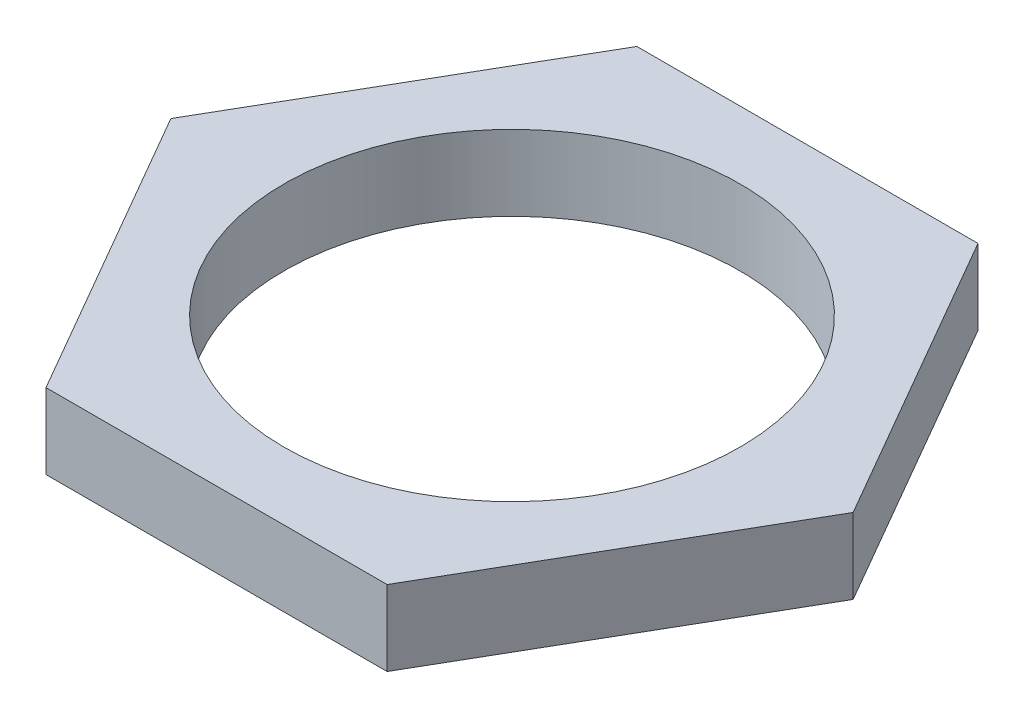
ISO-10303-21;
HEADER;
FILE_DESCRIPTION(('STEP AP214'),'2;1');
FILE_NAME('part.step','',(''),(''),'','','');
FILE_SCHEMA(('AUTOMOTIVE_DESIGN { 1 0 10303 214 1 1 1 1 }'));
ENDSEC;
DATA;
#1=APPLICATION_CONTEXT('core data for automotive mechanical design processes');
#2=APPLICATION_PROTOCOL_DEFINITION('international standard','automotive_design',2000,#1);
#3=PRODUCT_CONTEXT('',#1,'mechanical');
#4=PRODUCT('Part','Part','',(#3));
#5=PRODUCT_RELATED_PRODUCT_CATEGORY('part','',(#4));
#6=PRODUCT_DEFINITION_FORMATION('','',#4);
#7=PRODUCT_DEFINITION_CONTEXT('part definition',#1,'design');
#8=PRODUCT_DEFINITION('design','',#6,#7);
#9=PRODUCT_DEFINITION_SHAPE('','',#8);
#10=(LENGTH_UNIT() NAMED_UNIT(*) SI_UNIT(.MILLI.,.METRE.));
#11=(NAMED_UNIT(*) PLANE_ANGLE_UNIT() SI_UNIT($,.RADIAN.));
#12=(NAMED_UNIT(*) SI_UNIT($,.STERADIAN.) SOLID_ANGLE_UNIT());
#13=UNCERTAINTY_MEASURE_WITH_UNIT(LENGTH_MEASURE(1.E-05),#10,'distance_accuracy_value','');
#14=(GEOMETRIC_REPRESENTATION_CONTEXT(3) GLOBAL_UNCERTAINTY_ASSIGNED_CONTEXT((#13)) GLOBAL_UNIT_ASSIGNED_CONTEXT((#10,
#11,#12)) REPRESENTATION_CONTEXT('',''));
#15=CARTESIAN_POINT('',(0.,0.,0.));
#16=DIRECTION('',(0.,0.,1.));
#17=DIRECTION('',(1.,0.,0.));
#18=AXIS2_PLACEMENT_3D('',#15,#16,#17);
#19=CARTESIAN_POINT('',(0.,1.9,0.));
#20=DIRECTION('',(0.,1.,0.));
#21=DIRECTION('',(0.,0.,1.));
#22=AXIS2_PLACEMENT_3D('',#19,#20,#21);
#23=PLANE('',#22);
#24=DIRECTION('',(-0.499999999999995,0.,0.866025403784442));
#25=VECTOR('',#24,1.);
#26=CARTESIAN_POINT('',(-4.30125950546279,1.9,-7.44999999999994));
#27=LINE('',#26,#25);
#28=CARTESIAN_POINT('',(-4.30125950546279,1.9,-7.44999999999994));
#29=VERTEX_POINT('',#28);
#30=CARTESIAN_POINT('',(-8.60251901092541,1.9,0.));
#31=VERTEX_POINT('',#30);
#32=EDGE_CURVE('E129',#29,#31,#27,.T.);
#33=ORIENTED_EDGE('',*,*,#32,.T.);
#34=DIRECTION('',(0.500000000000001,0.,0.866025403784438));
#35=VECTOR('',#34,1.);
#36=CARTESIAN_POINT('',(-8.60251901092541,1.9,0.));
#37=LINE('',#36,#35);
#38=CARTESIAN_POINT('',(-4.30125950546269,1.9,7.45));
#39=VERTEX_POINT('',#38);
#40=EDGE_CURVE('E87',#31,#39,#37,.T.);
#41=ORIENTED_EDGE('',*,*,#40,.T.);
#42=DIRECTION('',(1.,0.,0.));
#43=VECTOR('',#42,1.);
#44=CARTESIAN_POINT('',(-4.30125950546269,1.9,7.45));
#45=LINE('',#44,#43);
#46=CARTESIAN_POINT('',(4.30125950546274,1.9,7.44999999999997));
#47=VERTEX_POINT('',#46);
#48=EDGE_CURVE('E100',#39,#47,#45,.T.);
#49=ORIENTED_EDGE('',*,*,#48,.T.);
#50=DIRECTION('',(0.499999999999995,0.,-0.866025403784442));
#51=VECTOR('',#50,1.);
#52=CARTESIAN_POINT('',(4.30125950546274,1.9,7.44999999999997));
#53=LINE('',#52,#51);
#54=CARTESIAN_POINT('',(8.60251901092541,1.9,0.));
#55=VERTEX_POINT('',#54);
#56=EDGE_CURVE('E94',#47,#55,#53,.T.);
#57=ORIENTED_EDGE('',*,*,#56,.T.);
#58=DIRECTION('',(-0.500000000000007,0.,-0.866025403784435));
#59=VECTOR('',#58,1.);
#60=CARTESIAN_POINT('',(8.60251901092541,1.9,0.));
#61=LINE('',#60,#59);
#62=CARTESIAN_POINT('',(4.30125950546264,1.9,-7.45000000000003));
#63=VERTEX_POINT('',#62);
#64=EDGE_CURVE('E98',#55,#63,#61,.T.);
#65=ORIENTED_EDGE('',*,*,#64,.T.);
#66=DIRECTION('',(-1.,0.,0.));
#67=VECTOR('',#66,1.);
#68=CARTESIAN_POINT('',(4.30125950546264,1.9,-7.45000000000003));
#69=LINE('',#68,#67);
#70=EDGE_CURVE('E50',#63,#29,#69,.T.);
#71=ORIENTED_EDGE('',*,*,#70,.T.);
#72=EDGE_LOOP('',(#33,#41,#49,#57,#65,#71));
#73=FACE_BOUND('',#72,.T.);
#74=CARTESIAN_POINT('',(0.,1.9,0.));
#75=DIRECTION('',(0.,1.,0.));
#76=DIRECTION('',(0.,0.,1.));
#77=AXIS2_PLACEMENT_3D('',#74,#75,#76);
#78=CIRCLE('',#77,5.75);
#79=CARTESIAN_POINT('',(0.,1.9,5.75));
#80=VERTEX_POINT('',#79);
#81=EDGE_CURVE('E122',#80,#80,#78,.T.);
#82=ORIENTED_EDGE('',*,*,#81,.F.);
#83=EDGE_LOOP('',(#82));
#84=FACE_BOUND('',#83,.T.);
#85=ADVANCED_FACE('F33',(#73,#84),#23,.T.);
#86=CARTESIAN_POINT('',(0.,0.,0.));
#87=DIRECTION('',(0.,1.,0.));
#88=DIRECTION('',(0.,0.,1.));
#89=AXIS2_PLACEMENT_3D('',#86,#87,#88);
#90=PLANE('',#89);
#91=DIRECTION('',(-0.499999999999995,0.,0.866025403784442));
#92=VECTOR('',#91,1.);
#93=CARTESIAN_POINT('',(-4.30125950546279,0.,-7.44999999999994));
#94=LINE('',#93,#92);
#95=CARTESIAN_POINT('',(-4.30125950546279,0.,-7.44999999999994));
#96=VERTEX_POINT('',#95);
#97=CARTESIAN_POINT('',(-8.60251901092541,0.,0.));
#98=VERTEX_POINT('',#97);
#99=EDGE_CURVE('E118',#96,#98,#94,.T.);
#100=ORIENTED_EDGE('',*,*,#99,.F.);
#101=DIRECTION('',(-1.,0.,0.));
#102=VECTOR('',#101,1.);
#103=CARTESIAN_POINT('',(4.30125950546264,0.,-7.45000000000003));
#104=LINE('',#103,#102);
#105=CARTESIAN_POINT('',(4.30125950546264,0.,-7.45000000000003));
#106=VERTEX_POINT('',#105);
#107=EDGE_CURVE('E79',#106,#96,#104,.T.);
#108=ORIENTED_EDGE('',*,*,#107,.F.);
#109=DIRECTION('',(-0.500000000000007,0.,-0.866025403784435));
#110=VECTOR('',#109,1.);
#111=CARTESIAN_POINT('',(8.60251901092541,0.,0.));
#112=LINE('',#111,#110);
#113=CARTESIAN_POINT('',(8.60251901092541,0.,0.));
#114=VERTEX_POINT('',#113);
#115=EDGE_CURVE('E73',#114,#106,#112,.T.);
#116=ORIENTED_EDGE('',*,*,#115,.F.);
#117=DIRECTION('',(0.499999999999995,0.,-0.866025403784442));
#118=VECTOR('',#117,1.);
#119=CARTESIAN_POINT('',(4.30125950546274,0.,7.44999999999997));
#120=LINE('',#119,#118);
#121=CARTESIAN_POINT('',(4.30125950546274,0.,7.44999999999997));
#122=VERTEX_POINT('',#121);
#123=EDGE_CURVE('E108',#122,#114,#120,.T.);
#124=ORIENTED_EDGE('',*,*,#123,.F.);
#125=DIRECTION('',(1.,0.,0.));
#126=VECTOR('',#125,1.);
#127=CARTESIAN_POINT('',(-4.30125950546269,0.,7.45));
#128=LINE('',#127,#126);
#129=CARTESIAN_POINT('',(-4.30125950546269,0.,7.45));
#130=VERTEX_POINT('',#129);
#131=EDGE_CURVE('E124',#130,#122,#128,.T.);
#132=ORIENTED_EDGE('',*,*,#131,.F.);
#133=DIRECTION('',(0.500000000000001,0.,0.866025403784438));
#134=VECTOR('',#133,1.);
#135=CARTESIAN_POINT('',(-8.60251901092541,0.,0.));
#136=LINE('',#135,#134);
#137=EDGE_CURVE('E121',#98,#130,#136,.T.);
#138=ORIENTED_EDGE('',*,*,#137,.F.);
#139=EDGE_LOOP('',(#100,#108,#116,#124,#132,#138));
#140=FACE_BOUND('',#139,.T.);
#141=CARTESIAN_POINT('',(0.,0.,0.));
#142=DIRECTION('',(0.,1.,0.));
#143=DIRECTION('',(0.,0.,1.));
#144=AXIS2_PLACEMENT_3D('',#141,#142,#143);
#145=CIRCLE('',#144,5.75);
#146=CARTESIAN_POINT('',(0.,0.,5.75));
#147=VERTEX_POINT('',#146);
#148=EDGE_CURVE('E222',#147,#147,#145,.T.);
#149=ORIENTED_EDGE('',*,*,#148,.T.);
#150=EDGE_LOOP('',(#149));
#151=FACE_BOUND('',#150,.T.);
#152=ADVANCED_FACE('F138',(#140,#151),#90,.F.);
#153=CARTESIAN_POINT('',(-4.30125950546279,1.9,-7.44999999999994));
#154=DIRECTION('',(0.866025403784442,0.,0.499999999999995));
#155=DIRECTION('',(0.499999999999995,0.,-0.866025403784442));
#156=AXIS2_PLACEMENT_3D('',#153,#154,#155);
#157=PLANE('',#156);
#158=ORIENTED_EDGE('',*,*,#99,.T.);
#159=DIRECTION('',(0.,-1.,0.));
#160=VECTOR('',#159,1.);
#161=CARTESIAN_POINT('',(-8.60251901092541,1.9,0.));
#162=LINE('',#161,#160);
#163=EDGE_CURVE('E11',#31,#98,#162,.T.);
#164=ORIENTED_EDGE('',*,*,#163,.F.);
#165=ORIENTED_EDGE('',*,*,#32,.F.);
#166=DIRECTION('',(0.,-1.,0.));
#167=VECTOR('',#166,1.);
#168=CARTESIAN_POINT('',(-4.30125950546279,1.9,-7.44999999999994));
#169=LINE('',#168,#167);
#170=EDGE_CURVE('E114',#29,#96,#169,.T.);
#171=ORIENTED_EDGE('',*,*,#170,.T.);
#172=EDGE_LOOP('',(#158,#164,#165,#171));
#173=FACE_BOUND('',#172,.T.);
#174=ADVANCED_FACE('F35',(#173),#157,.F.);
#175=CARTESIAN_POINT('',(-8.60251901092541,1.9,0.));
#176=DIRECTION('',(0.866025403784438,0.,-0.500000000000001));
#177=DIRECTION('',(-0.500000000000001,0.,-0.866025403784438));
#178=AXIS2_PLACEMENT_3D('',#175,#176,#177);
#179=PLANE('',#178);
#180=ORIENTED_EDGE('',*,*,#137,.T.);
#181=DIRECTION('',(0.,-1.,0.));
#182=VECTOR('',#181,1.);
#183=CARTESIAN_POINT('',(-4.30125950546269,1.9,7.45));
#184=LINE('',#183,#182);
#185=EDGE_CURVE('E42',#39,#130,#184,.T.);
#186=ORIENTED_EDGE('',*,*,#185,.F.);
#187=ORIENTED_EDGE('',*,*,#40,.F.);
#188=ORIENTED_EDGE('',*,*,#163,.T.);
#189=EDGE_LOOP('',(#180,#186,#187,#188));
#190=FACE_BOUND('',#189,.T.);
#191=ADVANCED_FACE('F163',(#190),#179,.F.);
#192=CARTESIAN_POINT('',(-4.30125950546269,1.9,7.45));
#193=DIRECTION('',(0.,0.,-1.));
#194=DIRECTION('',(-1.,0.,0.));
#195=AXIS2_PLACEMENT_3D('',#192,#193,#194);
#196=PLANE('',#195);
#197=ORIENTED_EDGE('',*,*,#131,.T.);
#198=DIRECTION('',(0.,-1.,0.));
#199=VECTOR('',#198,1.);
#200=CARTESIAN_POINT('',(4.30125950546274,1.9,7.44999999999997));
#201=LINE('',#200,#199);
#202=EDGE_CURVE('E109',#47,#122,#201,.T.);
#203=ORIENTED_EDGE('',*,*,#202,.F.);
#204=ORIENTED_EDGE('',*,*,#48,.F.);
#205=ORIENTED_EDGE('',*,*,#185,.T.);
#206=EDGE_LOOP('',(#197,#203,#204,#205));
#207=FACE_BOUND('',#206,.T.);
#208=ADVANCED_FACE('F135',(#207),#196,.F.);
#209=CARTESIAN_POINT('',(4.30125950546274,1.9,7.44999999999997));
#210=DIRECTION('',(-0.866025403784441,0.,-0.499999999999995));
#211=DIRECTION('',(-0.499999999999995,0.,0.866025403784442));
#212=AXIS2_PLACEMENT_3D('',#209,#210,#211);
#213=PLANE('',#212);
#214=ORIENTED_EDGE('',*,*,#123,.T.);
#215=DIRECTION('',(0.,-1.,0.));
#216=VECTOR('',#215,1.);
#217=CARTESIAN_POINT('',(8.60251901092541,1.9,0.));
#218=LINE('',#217,#216);
#219=EDGE_CURVE('E105',#55,#114,#218,.T.);
#220=ORIENTED_EDGE('',*,*,#219,.F.);
#221=ORIENTED_EDGE('',*,*,#56,.F.);
#222=ORIENTED_EDGE('',*,*,#202,.T.);
#223=EDGE_LOOP('',(#214,#220,#221,#222));
#224=FACE_BOUND('',#223,.T.);
#225=ADVANCED_FACE('F106',(#224),#213,.F.);
#226=CARTESIAN_POINT('',(8.60251901092541,1.9,0.));
#227=DIRECTION('',(-0.866025403784434,0.,0.500000000000007));
#228=DIRECTION('',(0.500000000000007,0.,0.866025403784435));
#229=AXIS2_PLACEMENT_3D('',#226,#227,#228);
#230=PLANE('',#229);
#231=ORIENTED_EDGE('',*,*,#115,.T.);
#232=DIRECTION('',(0.,-1.,0.));
#233=VECTOR('',#232,1.);
#234=CARTESIAN_POINT('',(4.30125950546264,1.9,-7.45000000000003));
#235=LINE('',#234,#233);
#236=EDGE_CURVE('E110',#63,#106,#235,.T.);
#237=ORIENTED_EDGE('',*,*,#236,.F.);
#238=ORIENTED_EDGE('',*,*,#64,.F.);
#239=ORIENTED_EDGE('',*,*,#219,.T.);
#240=EDGE_LOOP('',(#231,#237,#238,#239));
#241=FACE_BOUND('',#240,.T.);
#242=ADVANCED_FACE('F112',(#241),#230,.F.);
#243=CARTESIAN_POINT('',(4.30125950546264,1.9,-7.45000000000003));
#244=DIRECTION('',(0.,0.,1.));
#245=DIRECTION('',(1.,0.,0.));
#246=AXIS2_PLACEMENT_3D('',#243,#244,#245);
#247=PLANE('',#246);
#248=ORIENTED_EDGE('',*,*,#107,.T.);
#249=ORIENTED_EDGE('',*,*,#170,.F.);
#250=ORIENTED_EDGE('',*,*,#70,.F.);
#251=ORIENTED_EDGE('',*,*,#236,.T.);
#252=EDGE_LOOP('',(#248,#249,#250,#251));
#253=FACE_BOUND('',#252,.T.);
#254=ADVANCED_FACE('F143',(#253),#247,.F.);
#255=CARTESIAN_POINT('',(0.,1.9,0.));
#256=DIRECTION('',(0.,-1.,0.));
#257=DIRECTION('',(0.,0.,-1.));
#258=AXIS2_PLACEMENT_3D('',#255,#256,#257);
#259=CYLINDRICAL_SURFACE('',#258,5.75);
#260=ORIENTED_EDGE('',*,*,#81,.T.);
#261=EDGE_LOOP('',(#260));
#262=FACE_BOUND('',#261,.T.);
#263=ORIENTED_EDGE('',*,*,#148,.F.);
#264=EDGE_LOOP('',(#263));
#265=FACE_BOUND('',#264,.T.);
#266=ADVANCED_FACE('F145',(#262,#265),#259,.F.);
#267=CLOSED_SHELL('',(#85,#152,#174,#191,#208,#225,#242,#254,#266));
#268=MANIFOLD_SOLID_BREP('B2',#267);
#269=ADVANCED_BREP_SHAPE_REPRESENTATION('',(#18,#268),#14);
#270=SHAPE_DEFINITION_REPRESENTATION(#9,#269);
ENDSEC;
END-ISO-10303-21;
